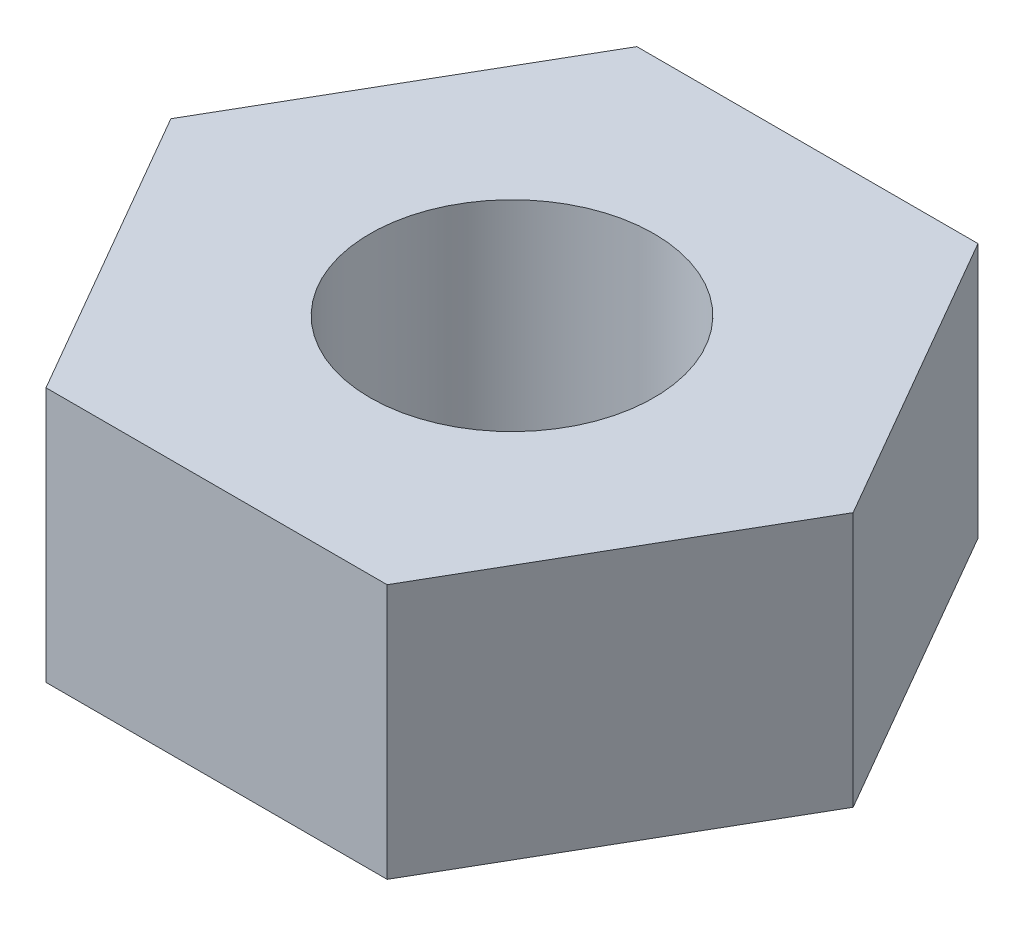
ISO-10303-21;
HEADER;
FILE_DESCRIPTION(('STEP AP214'),'2;1');
FILE_NAME('part.step','',(''),(''),'','','');
FILE_SCHEMA(('AUTOMOTIVE_DESIGN { 1 0 10303 214 1 1 1 1 }'));
ENDSEC;
DATA;
#1=APPLICATION_CONTEXT('core data for automotive mechanical design processes');
#2=APPLICATION_PROTOCOL_DEFINITION('international standard','automotive_design',2000,#1);
#3=PRODUCT_CONTEXT('',#1,'mechanical');
#4=PRODUCT('Part','Part','',(#3));
#5=PRODUCT_RELATED_PRODUCT_CATEGORY('part','',(#4));
#6=PRODUCT_DEFINITION_FORMATION('','',#4);
#7=PRODUCT_DEFINITION_CONTEXT('part definition',#1,'design');
#8=PRODUCT_DEFINITION('design','',#6,#7);
#9=PRODUCT_DEFINITION_SHAPE('','',#8);
#10=(LENGTH_UNIT() NAMED_UNIT(*) SI_UNIT(.MILLI.,.METRE.));
#11=(NAMED_UNIT(*) PLANE_ANGLE_UNIT() SI_UNIT($,.RADIAN.));
#12=(NAMED_UNIT(*) SI_UNIT($,.STERADIAN.) SOLID_ANGLE_UNIT());
#13=UNCERTAINTY_MEASURE_WITH_UNIT(LENGTH_MEASURE(1.E-05),#10,'distance_accuracy_value','');
#14=(GEOMETRIC_REPRESENTATION_CONTEXT(3) GLOBAL_UNCERTAINTY_ASSIGNED_CONTEXT((#13)) GLOBAL_UNIT_ASSIGNED_CONTEXT((#10,
#11,#12)) REPRESENTATION_CONTEXT('',''));
#15=CARTESIAN_POINT('',(0.,0.,0.));
#16=DIRECTION('',(0.,0.,1.));
#17=DIRECTION('',(1.,0.,0.));
#18=AXIS2_PLACEMENT_3D('',#15,#16,#17);
#19=CARTESIAN_POINT('',(-1.12294627357382,1.68,1.945));
#20=DIRECTION('',(0.,0.,-1.));
#21=DIRECTION('',(-1.,0.,0.));
#22=AXIS2_PLACEMENT_3D('',#19,#20,#21);
#23=PLANE('',#22);
#24=DIRECTION('',(1.,0.,0.));
#25=VECTOR('',#24,1.);
#26=CARTESIAN_POINT('',(-1.12294627357382,0.,1.945));
#27=LINE('',#26,#25);
#28=CARTESIAN_POINT('',(-1.12294627357382,0.,1.945));
#29=VERTEX_POINT('',#28);
#30=CARTESIAN_POINT('',(1.12294627357382,0.,1.945));
#31=VERTEX_POINT('',#30);
#32=EDGE_CURVE('E134',#29,#31,#27,.T.);
#33=ORIENTED_EDGE('',*,*,#32,.T.);
#34=DIRECTION('',(0.,-1.,0.));
#35=VECTOR('',#34,1.);
#36=CARTESIAN_POINT('',(1.12294627357382,1.68,1.945));
#37=LINE('',#36,#35);
#38=CARTESIAN_POINT('',(1.12294627357382,1.68,1.945));
#39=VERTEX_POINT('',#38);
#40=EDGE_CURVE('E11',#39,#31,#37,.T.);
#41=ORIENTED_EDGE('',*,*,#40,.F.);
#42=DIRECTION('',(1.,0.,0.));
#43=VECTOR('',#42,1.);
#44=CARTESIAN_POINT('',(-1.12294627357382,1.68,1.945));
#45=LINE('',#44,#43);
#46=CARTESIAN_POINT('',(-1.12294627357382,1.68,1.945));
#47=VERTEX_POINT('',#46);
#48=EDGE_CURVE('E151',#47,#39,#45,.T.);
#49=ORIENTED_EDGE('',*,*,#48,.F.);
#50=DIRECTION('',(0.,-1.,0.));
#51=VECTOR('',#50,1.);
#52=CARTESIAN_POINT('',(-1.12294627357382,1.68,1.945));
#53=LINE('',#52,#51);
#54=EDGE_CURVE('E130',#47,#29,#53,.T.);
#55=ORIENTED_EDGE('',*,*,#54,.T.);
#56=EDGE_LOOP('',(#33,#41,#49,#55));
#57=FACE_BOUND('',#56,.T.);
#58=ADVANCED_FACE('F45',(#57),#23,.F.);
#59=CARTESIAN_POINT('',(1.12294627357382,1.68,1.945));
#60=DIRECTION('',(-0.866025403784439,0.,-0.5));
#61=DIRECTION('',(-0.5,0.,0.866025403784439));
#62=AXIS2_PLACEMENT_3D('',#59,#60,#61);
#63=PLANE('',#62);
#64=DIRECTION('',(0.5,0.,-0.866025403784439));
#65=VECTOR('',#64,1.);
#66=CARTESIAN_POINT('',(1.12294627357382,0.,1.945));
#67=LINE('',#66,#65);
#68=CARTESIAN_POINT('',(2.24589254714764,0.,0.));
#69=VERTEX_POINT('',#68);
#70=EDGE_CURVE('E138',#31,#69,#67,.T.);
#71=ORIENTED_EDGE('',*,*,#70,.T.);
#72=DIRECTION('',(0.,-1.,0.));
#73=VECTOR('',#72,1.);
#74=CARTESIAN_POINT('',(2.24589254714764,1.68,0.));
#75=LINE('',#74,#73);
#76=CARTESIAN_POINT('',(2.24589254714764,1.68,0.));
#77=VERTEX_POINT('',#76);
#78=EDGE_CURVE('E54',#77,#69,#75,.T.);
#79=ORIENTED_EDGE('',*,*,#78,.F.);
#80=DIRECTION('',(0.5,0.,-0.866025403784439));
#81=VECTOR('',#80,1.);
#82=CARTESIAN_POINT('',(1.12294627357382,1.68,1.945));
#83=LINE('',#82,#81);
#84=EDGE_CURVE('E99',#39,#77,#83,.T.);
#85=ORIENTED_EDGE('',*,*,#84,.F.);
#86=ORIENTED_EDGE('',*,*,#40,.T.);
#87=EDGE_LOOP('',(#71,#79,#85,#86));
#88=FACE_BOUND('',#87,.T.);
#89=ADVANCED_FACE('F180',(#88),#63,.F.);
#90=CARTESIAN_POINT('',(2.24589254714764,1.68,0.));
#91=DIRECTION('',(-0.866025403784439,0.,0.5));
#92=DIRECTION('',(0.5,0.,0.866025403784439));
#93=AXIS2_PLACEMENT_3D('',#90,#91,#92);
#94=PLANE('',#93);
#95=DIRECTION('',(-0.5,0.,-0.866025403784439));
#96=VECTOR('',#95,1.);
#97=CARTESIAN_POINT('',(2.24589254714764,0.,0.));
#98=LINE('',#97,#96);
#99=CARTESIAN_POINT('',(1.12294627357382,0.,-1.945));
#100=VERTEX_POINT('',#99);
#101=EDGE_CURVE('E142',#69,#100,#98,.T.);
#102=ORIENTED_EDGE('',*,*,#101,.T.);
#103=DIRECTION('',(0.,-1.,0.));
#104=VECTOR('',#103,1.);
#105=CARTESIAN_POINT('',(1.12294627357382,1.68,-1.945));
#106=LINE('',#105,#104);
#107=CARTESIAN_POINT('',(1.12294627357382,1.68,-1.945));
#108=VERTEX_POINT('',#107);
#109=EDGE_CURVE('E123',#108,#100,#106,.T.);
#110=ORIENTED_EDGE('',*,*,#109,.F.);
#111=DIRECTION('',(-0.5,0.,-0.866025403784439));
#112=VECTOR('',#111,1.);
#113=CARTESIAN_POINT('',(2.24589254714764,1.68,0.));
#114=LINE('',#113,#112);
#115=EDGE_CURVE('E112',#77,#108,#114,.T.);
#116=ORIENTED_EDGE('',*,*,#115,.F.);
#117=ORIENTED_EDGE('',*,*,#78,.T.);
#118=EDGE_LOOP('',(#102,#110,#116,#117));
#119=FACE_BOUND('',#118,.T.);
#120=ADVANCED_FACE('F161',(#119),#94,.F.);
#121=CARTESIAN_POINT('',(1.12294627357382,1.68,-1.945));
#122=DIRECTION('',(0.,0.,1.));
#123=DIRECTION('',(1.,0.,0.));
#124=AXIS2_PLACEMENT_3D('',#121,#122,#123);
#125=PLANE('',#124);
#126=DIRECTION('',(-1.,0.,0.));
#127=VECTOR('',#126,1.);
#128=CARTESIAN_POINT('',(1.12294627357382,0.,-1.945));
#129=LINE('',#128,#127);
#130=CARTESIAN_POINT('',(-1.12294627357382,0.,-1.945));
#131=VERTEX_POINT('',#130);
#132=EDGE_CURVE('E121',#100,#131,#129,.T.);
#133=ORIENTED_EDGE('',*,*,#132,.T.);
#134=DIRECTION('',(0.,-1.,0.));
#135=VECTOR('',#134,1.);
#136=CARTESIAN_POINT('',(-1.12294627357382,1.68,-1.945));
#137=LINE('',#136,#135);
#138=CARTESIAN_POINT('',(-1.12294627357382,1.68,-1.945));
#139=VERTEX_POINT('',#138);
#140=EDGE_CURVE('E118',#139,#131,#137,.T.);
#141=ORIENTED_EDGE('',*,*,#140,.F.);
#142=DIRECTION('',(-1.,0.,0.));
#143=VECTOR('',#142,1.);
#144=CARTESIAN_POINT('',(1.12294627357382,1.68,-1.945));
#145=LINE('',#144,#143);
#146=EDGE_CURVE('E106',#108,#139,#145,.T.);
#147=ORIENTED_EDGE('',*,*,#146,.F.);
#148=ORIENTED_EDGE('',*,*,#109,.T.);
#149=EDGE_LOOP('',(#133,#141,#147,#148));
#150=FACE_BOUND('',#149,.T.);
#151=ADVANCED_FACE('F119',(#150),#125,.F.);
#152=CARTESIAN_POINT('',(-1.12294627357382,1.68,-1.945));
#153=DIRECTION('',(0.866025403784439,0.,0.5));
#154=DIRECTION('',(0.5,0.,-0.866025403784439));
#155=AXIS2_PLACEMENT_3D('',#152,#153,#154);
#156=PLANE('',#155);
#157=DIRECTION('',(-0.5,0.,0.866025403784439));
#158=VECTOR('',#157,1.);
#159=CARTESIAN_POINT('',(-1.12294627357382,0.,-1.945));
#160=LINE('',#159,#158);
#161=CARTESIAN_POINT('',(-2.24589254714764,0.,0.));
#162=VERTEX_POINT('',#161);
#163=EDGE_CURVE('E85',#131,#162,#160,.T.);
#164=ORIENTED_EDGE('',*,*,#163,.T.);
#165=DIRECTION('',(0.,-1.,0.));
#166=VECTOR('',#165,1.);
#167=CARTESIAN_POINT('',(-2.24589254714764,1.68,0.));
#168=LINE('',#167,#166);
#169=CARTESIAN_POINT('',(-2.24589254714764,1.68,0.));
#170=VERTEX_POINT('',#169);
#171=EDGE_CURVE('E124',#170,#162,#168,.T.);
#172=ORIENTED_EDGE('',*,*,#171,.F.);
#173=DIRECTION('',(-0.5,0.,0.866025403784439));
#174=VECTOR('',#173,1.);
#175=CARTESIAN_POINT('',(-1.12294627357382,1.68,-1.945));
#176=LINE('',#175,#174);
#177=EDGE_CURVE('E110',#139,#170,#176,.T.);
#178=ORIENTED_EDGE('',*,*,#177,.F.);
#179=ORIENTED_EDGE('',*,*,#140,.T.);
#180=EDGE_LOOP('',(#164,#172,#178,#179));
#181=FACE_BOUND('',#180,.T.);
#182=ADVANCED_FACE('F126',(#181),#156,.F.);
#183=CARTESIAN_POINT('',(-2.24589254714764,1.68,0.));
#184=DIRECTION('',(0.866025403784439,0.,-0.5));
#185=DIRECTION('',(-0.5,0.,-0.866025403784439));
#186=AXIS2_PLACEMENT_3D('',#183,#184,#185);
#187=PLANE('',#186);
#188=DIRECTION('',(0.5,0.,0.866025403784439));
#189=VECTOR('',#188,1.);
#190=CARTESIAN_POINT('',(-2.24589254714764,0.,0.));
#191=LINE('',#190,#189);
#192=EDGE_CURVE('E91',#162,#29,#191,.T.);
#193=ORIENTED_EDGE('',*,*,#192,.T.);
#194=ORIENTED_EDGE('',*,*,#54,.F.);
#195=DIRECTION('',(0.5,0.,0.866025403784439));
#196=VECTOR('',#195,1.);
#197=CARTESIAN_POINT('',(-2.24589254714764,1.68,0.));
#198=LINE('',#197,#196);
#199=EDGE_CURVE('E62',#170,#47,#198,.T.);
#200=ORIENTED_EDGE('',*,*,#199,.F.);
#201=ORIENTED_EDGE('',*,*,#171,.T.);
#202=EDGE_LOOP('',(#193,#194,#200,#201));
#203=FACE_BOUND('',#202,.T.);
#204=ADVANCED_FACE('F168',(#203),#187,.F.);
#205=CARTESIAN_POINT('',(0.,1.68,0.));
#206=DIRECTION('',(0.,1.,0.));
#207=DIRECTION('',(0.,0.,1.));
#208=AXIS2_PLACEMENT_3D('',#205,#206,#207);
#209=PLANE('',#208);
#210=CARTESIAN_POINT('',(0.,1.68,0.));
#211=DIRECTION('',(0.,1.,0.));
#212=DIRECTION('',(0.,0.,1.));
#213=AXIS2_PLACEMENT_3D('',#210,#211,#212);
#214=CIRCLE('',#213,0.935);
#215=CARTESIAN_POINT('',(0.,1.68,0.935));
#216=VERTEX_POINT('',#215);
#217=EDGE_CURVE('E236',#216,#216,#214,.T.);
#218=ORIENTED_EDGE('',*,*,#217,.F.);
#219=EDGE_LOOP('',(#218));
#220=FACE_BOUND('',#219,.T.);
#221=ORIENTED_EDGE('',*,*,#48,.T.);
#222=ORIENTED_EDGE('',*,*,#84,.T.);
#223=ORIENTED_EDGE('',*,*,#115,.T.);
#224=ORIENTED_EDGE('',*,*,#146,.T.);
#225=ORIENTED_EDGE('',*,*,#177,.T.);
#226=ORIENTED_EDGE('',*,*,#199,.T.);
#227=EDGE_LOOP('',(#221,#222,#223,#224,#225,#226));
#228=FACE_BOUND('',#227,.T.);
#229=ADVANCED_FACE('F108',(#220,#228),#209,.T.);
#230=CARTESIAN_POINT('',(0.,0.,0.));
#231=DIRECTION('',(0.,1.,0.));
#232=DIRECTION('',(0.,0.,1.));
#233=AXIS2_PLACEMENT_3D('',#230,#231,#232);
#234=PLANE('',#233);
#235=CARTESIAN_POINT('',(0.,0.,0.));
#236=DIRECTION('',(0.,1.,0.));
#237=DIRECTION('',(0.,0.,1.));
#238=AXIS2_PLACEMENT_3D('',#235,#236,#237);
#239=CIRCLE('',#238,0.935);
#240=CARTESIAN_POINT('',(0.,0.,0.935));
#241=VERTEX_POINT('',#240);
#242=EDGE_CURVE('E139',#241,#241,#239,.T.);
#243=ORIENTED_EDGE('',*,*,#242,.T.);
#244=EDGE_LOOP('',(#243));
#245=FACE_BOUND('',#244,.T.);
#246=ORIENTED_EDGE('',*,*,#32,.F.);
#247=ORIENTED_EDGE('',*,*,#192,.F.);
#248=ORIENTED_EDGE('',*,*,#163,.F.);
#249=ORIENTED_EDGE('',*,*,#132,.F.);
#250=ORIENTED_EDGE('',*,*,#101,.F.);
#251=ORIENTED_EDGE('',*,*,#70,.F.);
#252=EDGE_LOOP('',(#246,#247,#248,#249,#250,#251));
#253=FACE_BOUND('',#252,.T.);
#254=ADVANCED_FACE('F164',(#245,#253),#234,.F.);
#255=CARTESIAN_POINT('',(0.,0.,0.));
#256=DIRECTION('',(0.,1.,0.));
#257=DIRECTION('',(0.,0.,1.));
#258=AXIS2_PLACEMENT_3D('',#255,#256,#257);
#259=CYLINDRICAL_SURFACE('',#258,0.935);
#260=ORIENTED_EDGE('',*,*,#242,.F.);
#261=EDGE_LOOP('',(#260));
#262=FACE_BOUND('',#261,.T.);
#263=ORIENTED_EDGE('',*,*,#217,.T.);
#264=EDGE_LOOP('',(#263));
#265=FACE_BOUND('',#264,.T.);
#266=ADVANCED_FACE('F219',(#262,#265),#259,.F.);
#267=CLOSED_SHELL('',(#58,#89,#120,#151,#182,#204,#229,#254,#266));
#268=MANIFOLD_SOLID_BREP('B2',#267);
#269=ADVANCED_BREP_SHAPE_REPRESENTATION('',(#18,#268),#14);
#270=SHAPE_DEFINITION_REPRESENTATION(#9,#269);
ENDSEC;
END-ISO-10303-21;
